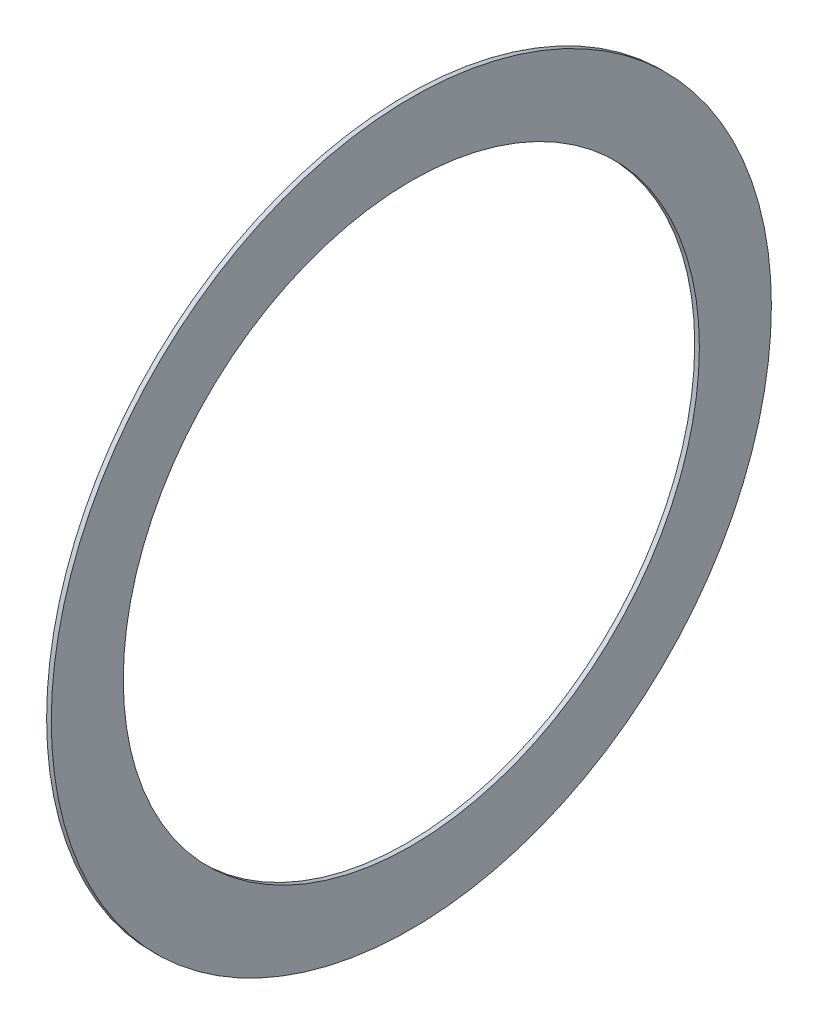
ISO-10303-21;
HEADER;
FILE_DESCRIPTION(('STEP AP214'),'2;1');
FILE_NAME('part.step','',(''),(''),'','','');
FILE_SCHEMA(('AUTOMOTIVE_DESIGN { 1 0 10303 214 1 1 1 1 }'));
ENDSEC;
DATA;
#1=APPLICATION_CONTEXT('core data for automotive mechanical design processes');
#2=APPLICATION_PROTOCOL_DEFINITION('international standard','automotive_design',2000,#1);
#3=PRODUCT_CONTEXT('',#1,'mechanical');
#4=PRODUCT('Part','Part','',(#3));
#5=PRODUCT_RELATED_PRODUCT_CATEGORY('part','',(#4));
#6=PRODUCT_DEFINITION_FORMATION('','',#4);
#7=PRODUCT_DEFINITION_CONTEXT('part definition',#1,'design');
#8=PRODUCT_DEFINITION('design','',#6,#7);
#9=PRODUCT_DEFINITION_SHAPE('','',#8);
#10=(LENGTH_UNIT() NAMED_UNIT(*) SI_UNIT(.MILLI.,.METRE.));
#11=(NAMED_UNIT(*) PLANE_ANGLE_UNIT() SI_UNIT($,.RADIAN.));
#12=(NAMED_UNIT(*) SI_UNIT($,.STERADIAN.) SOLID_ANGLE_UNIT());
#13=UNCERTAINTY_MEASURE_WITH_UNIT(LENGTH_MEASURE(1.E-05),#10,'distance_accuracy_value','');
#14=(GEOMETRIC_REPRESENTATION_CONTEXT(3) GLOBAL_UNCERTAINTY_ASSIGNED_CONTEXT((#13)) GLOBAL_UNIT_ASSIGNED_CONTEXT((#10,
#11,#12)) REPRESENTATION_CONTEXT('',''));
#15=CARTESIAN_POINT('',(0.,0.,0.));
#16=DIRECTION('',(0.,0.,1.));
#17=DIRECTION('',(1.,0.,0.));
#18=AXIS2_PLACEMENT_3D('',#15,#16,#17);
#19=CARTESIAN_POINT('',(2.,0.,0.));
#20=DIRECTION('',(1.,0.,0.));
#21=DIRECTION('',(0.,0.,-1.));
#22=AXIS2_PLACEMENT_3D('',#19,#20,#21);
#23=PLANE('',#22);
#24=CARTESIAN_POINT('',(2.,0.,0.));
#25=DIRECTION('',(1.,0.,0.));
#26=DIRECTION('',(0.,0.,-1.));
#27=AXIS2_PLACEMENT_3D('',#24,#25,#26);
#28=CIRCLE('',#27,155.);
#29=CARTESIAN_POINT('',(2.,0.,-155.));
#30=VERTEX_POINT('',#29);
#31=EDGE_CURVE('E10',#30,#30,#28,.T.);
#32=ORIENTED_EDGE('',*,*,#31,.T.);
#33=EDGE_LOOP('',(#32));
#34=FACE_BOUND('',#33,.T.);
#35=CARTESIAN_POINT('',(2.,0.,0.));
#36=DIRECTION('',(1.,0.,0.));
#37=DIRECTION('',(0.,0.,-1.));
#38=AXIS2_PLACEMENT_3D('',#35,#36,#37);
#39=CIRCLE('',#38,124.);
#40=CARTESIAN_POINT('',(2.,0.,-124.));
#41=VERTEX_POINT('',#40);
#42=EDGE_CURVE('E50',#41,#41,#39,.T.);
#43=ORIENTED_EDGE('',*,*,#42,.F.);
#44=EDGE_LOOP('',(#43));
#45=FACE_BOUND('',#44,.T.);
#46=ADVANCED_FACE('F37',(#34,#45),#23,.T.);
#47=CARTESIAN_POINT('',(0.,0.,0.));
#48=DIRECTION('',(1.,0.,0.));
#49=DIRECTION('',(0.,0.,-1.));
#50=AXIS2_PLACEMENT_3D('',#47,#48,#49);
#51=PLANE('',#50);
#52=CARTESIAN_POINT('',(0.,0.,0.));
#53=DIRECTION('',(1.,0.,0.));
#54=DIRECTION('',(0.,0.,-1.));
#55=AXIS2_PLACEMENT_3D('',#52,#53,#54);
#56=CIRCLE('',#55,155.);
#57=CARTESIAN_POINT('',(0.,0.,-155.));
#58=VERTEX_POINT('',#57);
#59=EDGE_CURVE('E41',#58,#58,#56,.T.);
#60=ORIENTED_EDGE('',*,*,#59,.F.);
#61=EDGE_LOOP('',(#60));
#62=FACE_BOUND('',#61,.T.);
#63=CARTESIAN_POINT('',(0.,0.,0.));
#64=DIRECTION('',(1.,0.,0.));
#65=DIRECTION('',(0.,0.,-1.));
#66=AXIS2_PLACEMENT_3D('',#63,#64,#65);
#67=CIRCLE('',#66,124.);
#68=CARTESIAN_POINT('',(0.,0.,-124.));
#69=VERTEX_POINT('',#68);
#70=EDGE_CURVE('E52',#69,#69,#67,.T.);
#71=ORIENTED_EDGE('',*,*,#70,.T.);
#72=EDGE_LOOP('',(#71));
#73=FACE_BOUND('',#72,.T.);
#74=ADVANCED_FACE('F64',(#62,#73),#51,.F.);
#75=CARTESIAN_POINT('',(2.,0.,0.));
#76=DIRECTION('',(-1.,0.,0.));
#77=DIRECTION('',(0.,0.,1.));
#78=AXIS2_PLACEMENT_3D('',#75,#76,#77);
#79=CYLINDRICAL_SURFACE('',#78,155.);
#80=ORIENTED_EDGE('',*,*,#31,.F.);
#81=EDGE_LOOP('',(#80));
#82=FACE_BOUND('',#81,.T.);
#83=ORIENTED_EDGE('',*,*,#59,.T.);
#84=EDGE_LOOP('',(#83));
#85=FACE_BOUND('',#84,.T.);
#86=ADVANCED_FACE('F39',(#82,#85),#79,.T.);
#87=CARTESIAN_POINT('',(2.,0.,0.));
#88=DIRECTION('',(-1.,0.,0.));
#89=DIRECTION('',(0.,0.,1.));
#90=AXIS2_PLACEMENT_3D('',#87,#88,#89);
#91=CYLINDRICAL_SURFACE('',#90,124.);
#92=ORIENTED_EDGE('',*,*,#42,.T.);
#93=EDGE_LOOP('',(#92));
#94=FACE_BOUND('',#93,.T.);
#95=ORIENTED_EDGE('',*,*,#70,.F.);
#96=EDGE_LOOP('',(#95));
#97=FACE_BOUND('',#96,.T.);
#98=ADVANCED_FACE('F60',(#94,#97),#91,.F.);
#99=CLOSED_SHELL('',(#46,#74,#86,#98));
#100=MANIFOLD_SOLID_BREP('B2',#99);
#101=ADVANCED_BREP_SHAPE_REPRESENTATION('',(#18,#100),#14);
#102=SHAPE_DEFINITION_REPRESENTATION(#9,#101);
ENDSEC;
END-ISO-10303-21;
